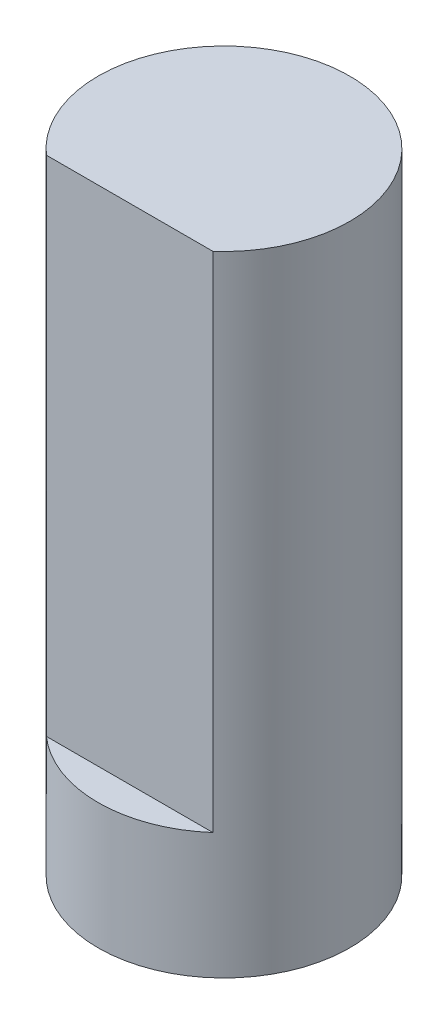
ISO-10303-21;
HEADER;
FILE_DESCRIPTION(('STEP AP214'),'2;1');
FILE_NAME('part.step','',(''),(''),'','','');
FILE_SCHEMA(('AUTOMOTIVE_DESIGN { 1 0 10303 214 1 1 1 1 }'));
ENDSEC;
DATA;
#1=APPLICATION_CONTEXT('core data for automotive mechanical design processes');
#2=APPLICATION_PROTOCOL_DEFINITION('international standard','automotive_design',2000,#1);
#3=PRODUCT_CONTEXT('',#1,'mechanical');
#4=PRODUCT('Part','Part','',(#3));
#5=PRODUCT_RELATED_PRODUCT_CATEGORY('part','',(#4));
#6=PRODUCT_DEFINITION_FORMATION('','',#4);
#7=PRODUCT_DEFINITION_CONTEXT('part definition',#1,'design');
#8=PRODUCT_DEFINITION('design','',#6,#7);
#9=PRODUCT_DEFINITION_SHAPE('','',#8);
#10=(LENGTH_UNIT() NAMED_UNIT(*) SI_UNIT(.MILLI.,.METRE.));
#11=(NAMED_UNIT(*) PLANE_ANGLE_UNIT() SI_UNIT($,.RADIAN.));
#12=(NAMED_UNIT(*) SI_UNIT($,.STERADIAN.) SOLID_ANGLE_UNIT());
#13=UNCERTAINTY_MEASURE_WITH_UNIT(LENGTH_MEASURE(1.E-05),#10,'distance_accuracy_value','');
#14=(GEOMETRIC_REPRESENTATION_CONTEXT(3) GLOBAL_UNCERTAINTY_ASSIGNED_CONTEXT((#13)) GLOBAL_UNIT_ASSIGNED_CONTEXT((#10,
#11,#12)) REPRESENTATION_CONTEXT('',''));
#15=CARTESIAN_POINT('',(0.,0.,0.));
#16=DIRECTION('',(0.,0.,1.));
#17=DIRECTION('',(1.,0.,0.));
#18=AXIS2_PLACEMENT_3D('',#15,#16,#17);
#19=CARTESIAN_POINT('',(0.,10.,0.));
#20=DIRECTION('',(0.,-1.,0.));
#21=DIRECTION('',(0.,0.,-1.));
#22=AXIS2_PLACEMENT_3D('',#19,#20,#21);
#23=CYLINDRICAL_SURFACE('',#22,2.);
#24=CARTESIAN_POINT('',(0.,10.,0.));
#25=DIRECTION('',(0.,1.,0.));
#26=DIRECTION('',(0.,0.,1.));
#27=AXIS2_PLACEMENT_3D('',#24,#25,#26);
#28=CIRCLE('',#27,2.);
#29=CARTESIAN_POINT('',(1.3228756555323,10.,1.5));
#30=VERTEX_POINT('',#29);
#31=CARTESIAN_POINT('',(-1.3228756555323,10.,1.5));
#32=VERTEX_POINT('',#31);
#33=EDGE_CURVE('E11',#30,#32,#28,.T.);
#34=ORIENTED_EDGE('',*,*,#33,.F.);
#35=DIRECTION('',(0.,1.,0.));
#36=VECTOR('',#35,1.);
#37=CARTESIAN_POINT('',(1.3228756555323,2.,1.5));
#38=LINE('',#37,#36);
#39=CARTESIAN_POINT('',(1.3228756555323,2.,1.5));
#40=VERTEX_POINT('',#39);
#41=EDGE_CURVE('E47',#40,#30,#38,.T.);
#42=ORIENTED_EDGE('',*,*,#41,.F.);
#43=CARTESIAN_POINT('',(0.,2.,0.));
#44=DIRECTION('',(0.,1.,0.));
#45=DIRECTION('',(0.,0.,1.));
#46=AXIS2_PLACEMENT_3D('',#43,#44,#45);
#47=CIRCLE('',#46,2.);
#48=CARTESIAN_POINT('',(-1.3228756555323,2.,1.5));
#49=VERTEX_POINT('',#48);
#50=EDGE_CURVE('E62',#49,#40,#47,.T.);
#51=ORIENTED_EDGE('',*,*,#50,.F.);
#52=DIRECTION('',(0.,1.,0.));
#53=VECTOR('',#52,1.);
#54=CARTESIAN_POINT('',(-1.3228756555323,2.,1.5));
#55=LINE('',#54,#53);
#56=EDGE_CURVE('E53',#49,#32,#55,.T.);
#57=ORIENTED_EDGE('',*,*,#56,.T.);
#58=EDGE_LOOP('',(#34,#42,#51,#57));
#59=FACE_BOUND('',#58,.T.);
#60=CARTESIAN_POINT('',(0.,0.,0.));
#61=DIRECTION('',(0.,1.,0.));
#62=DIRECTION('',(0.,0.,1.));
#63=AXIS2_PLACEMENT_3D('',#60,#61,#62);
#64=CIRCLE('',#63,2.);
#65=CARTESIAN_POINT('',(0.,0.,2.));
#66=VERTEX_POINT('',#65);
#67=EDGE_CURVE('E36',#66,#66,#64,.T.);
#68=ORIENTED_EDGE('',*,*,#67,.T.);
#69=EDGE_LOOP('',(#68));
#70=FACE_BOUND('',#69,.T.);
#71=ADVANCED_FACE('F33',(#59,#70),#23,.T.);
#72=CARTESIAN_POINT('',(0.,10.,0.));
#73=DIRECTION('',(0.,1.,0.));
#74=DIRECTION('',(0.,0.,1.));
#75=AXIS2_PLACEMENT_3D('',#72,#73,#74);
#76=PLANE('',#75);
#77=DIRECTION('',(-1.,0.,0.));
#78=VECTOR('',#77,1.);
#79=CARTESIAN_POINT('',(-1.3228756555323,10.,1.5));
#80=LINE('',#79,#78);
#81=EDGE_CURVE('E58',#30,#32,#80,.T.);
#82=ORIENTED_EDGE('',*,*,#81,.F.);
#83=ORIENTED_EDGE('',*,*,#33,.T.);
#84=EDGE_LOOP('',(#82,#83));
#85=FACE_BOUND('',#84,.T.);
#86=ADVANCED_FACE('F68',(#85),#76,.T.);
#87=CARTESIAN_POINT('',(0.,0.,0.));
#88=DIRECTION('',(0.,1.,0.));
#89=DIRECTION('',(0.,0.,1.));
#90=AXIS2_PLACEMENT_3D('',#87,#88,#89);
#91=PLANE('',#90);
#92=ORIENTED_EDGE('',*,*,#67,.F.);
#93=EDGE_LOOP('',(#92));
#94=FACE_BOUND('',#93,.T.);
#95=ADVANCED_FACE('F70',(#94),#91,.F.);
#96=CARTESIAN_POINT('',(-1.3228756555323,2.,1.5));
#97=DIRECTION('',(0.,0.,-1.));
#98=DIRECTION('',(-1.,0.,0.));
#99=AXIS2_PLACEMENT_3D('',#96,#97,#98);
#100=PLANE('',#99);
#101=ORIENTED_EDGE('',*,*,#81,.T.);
#102=ORIENTED_EDGE('',*,*,#56,.F.);
#103=DIRECTION('',(-1.,0.,0.));
#104=VECTOR('',#103,1.);
#105=CARTESIAN_POINT('',(-1.3228756555323,2.,1.5));
#106=LINE('',#105,#104);
#107=EDGE_CURVE('E85',#40,#49,#106,.T.);
#108=ORIENTED_EDGE('',*,*,#107,.F.);
#109=ORIENTED_EDGE('',*,*,#41,.T.);
#110=EDGE_LOOP('',(#101,#102,#108,#109));
#111=FACE_BOUND('',#110,.T.);
#112=ADVANCED_FACE('F59',(#111),#100,.F.);
#113=CARTESIAN_POINT('',(0.,2.,0.));
#114=DIRECTION('',(0.,1.,0.));
#115=DIRECTION('',(0.,0.,1.));
#116=AXIS2_PLACEMENT_3D('',#113,#114,#115);
#117=PLANE('',#116);
#118=ORIENTED_EDGE('',*,*,#50,.T.);
#119=ORIENTED_EDGE('',*,*,#107,.T.);
#120=EDGE_LOOP('',(#118,#119));
#121=FACE_BOUND('',#120,.T.);
#122=ADVANCED_FACE('F80',(#121),#117,.T.);
#123=CLOSED_SHELL('',(#71,#86,#95,#112,#122));
#124=MANIFOLD_SOLID_BREP('B2',#123);
#125=ADVANCED_BREP_SHAPE_REPRESENTATION('',(#18,#124),#14);
#126=SHAPE_DEFINITION_REPRESENTATION(#9,#125);
ENDSEC;
END-ISO-10303-21;
